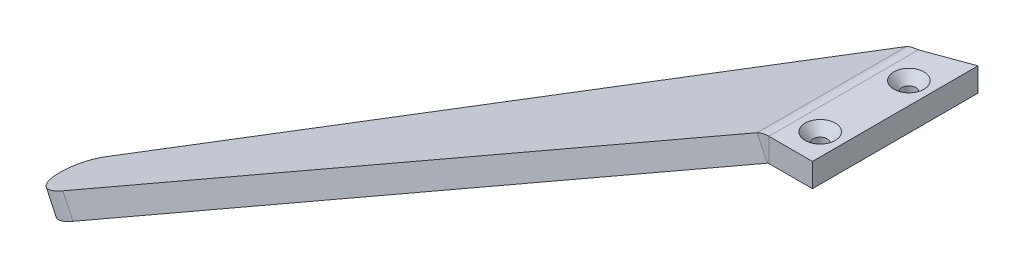
ISO-10303-21;
HEADER;
FILE_DESCRIPTION(('STEP AP214'),'2;1');
FILE_NAME('part.step','',(''),(''),'','','');
FILE_SCHEMA(('AUTOMOTIVE_DESIGN { 1 0 10303 214 1 1 1 1 }'));
ENDSEC;
DATA;
#1=APPLICATION_CONTEXT('core data for automotive mechanical design processes');
#2=APPLICATION_PROTOCOL_DEFINITION('international standard','automotive_design',2000,#1);
#3=PRODUCT_CONTEXT('',#1,'mechanical');
#4=PRODUCT('Part','Part','',(#3));
#5=PRODUCT_RELATED_PRODUCT_CATEGORY('part','',(#4));
#6=PRODUCT_DEFINITION_FORMATION('','',#4);
#7=PRODUCT_DEFINITION_CONTEXT('part definition',#1,'design');
#8=PRODUCT_DEFINITION('design','',#6,#7);
#9=PRODUCT_DEFINITION_SHAPE('','',#8);
#10=(LENGTH_UNIT() NAMED_UNIT(*) SI_UNIT(.MILLI.,.METRE.));
#11=(NAMED_UNIT(*) PLANE_ANGLE_UNIT() SI_UNIT($,.RADIAN.));
#12=(NAMED_UNIT(*) SI_UNIT($,.STERADIAN.) SOLID_ANGLE_UNIT());
#13=UNCERTAINTY_MEASURE_WITH_UNIT(LENGTH_MEASURE(1.E-05),#10,'distance_accuracy_value','');
#14=(GEOMETRIC_REPRESENTATION_CONTEXT(3) GLOBAL_UNCERTAINTY_ASSIGNED_CONTEXT((#13)) GLOBAL_UNIT_ASSIGNED_CONTEXT((#10,
#11,#12)) REPRESENTATION_CONTEXT('',''));
#15=CARTESIAN_POINT('',(0.,0.,0.));
#16=DIRECTION('',(0.,0.,1.));
#17=DIRECTION('',(1.,0.,0.));
#18=AXIS2_PLACEMENT_3D('',#15,#16,#17);
#19=CARTESIAN_POINT('',(0.,-5.08,0.));
#20=DIRECTION('',(0.,1.,0.));
#21=DIRECTION('',(0.,0.,1.));
#22=AXIS2_PLACEMENT_3D('',#19,#20,#21);
#23=PLANE('',#22);
#24=CARTESIAN_POINT('',(-4.68084985574861,-5.08,11.43));
#25=DIRECTION('',(0.,1.,0.));
#26=DIRECTION('',(0.,0.,1.));
#27=AXIS2_PLACEMENT_3D('',#24,#25,#26);
#28=CIRCLE('',#27,1.47319999999999);
#29=CARTESIAN_POINT('',(-4.68084985574861,-5.08,12.9032));
#30=VERTEX_POINT('',#29);
#31=EDGE_CURVE('E245',#30,#30,#28,.T.);
#32=ORIENTED_EDGE('',*,*,#31,.T.);
#33=EDGE_LOOP('',(#32));
#34=FACE_BOUND('',#33,.T.);
#35=CARTESIAN_POINT('',(-4.68084985574861,-5.08,-7.62));
#36=DIRECTION('',(0.,1.,0.));
#37=DIRECTION('',(0.,0.,1.));
#38=AXIS2_PLACEMENT_3D('',#35,#36,#37);
#39=CIRCLE('',#38,1.47319999999999);
#40=CARTESIAN_POINT('',(-4.68084985574861,-5.08,-6.14680000000002));
#41=VERTEX_POINT('',#40);
#42=EDGE_CURVE('E241',#41,#41,#39,.T.);
#43=ORIENTED_EDGE('',*,*,#42,.T.);
#44=EDGE_LOOP('',(#43));
#45=FACE_BOUND('',#44,.T.);
#46=DIRECTION('',(1.,1.06229051514945E-13,0.));
#47=VECTOR('',#46,1.);
#48=CARTESIAN_POINT('',(-9.525,-5.08,-14.3131835186145));
#49=LINE('',#48,#47);
#50=CARTESIAN_POINT('',(-9.525,-5.08,-14.3131835186145));
#51=VERTEX_POINT('',#50);
#52=CARTESIAN_POINT('',(-9.36169971149721,-5.07999999999998,-14.3131835186145));
#53=VERTEX_POINT('',#52);
#54=EDGE_CURVE('E208',#51,#53,#49,.T.);
#55=ORIENTED_EDGE('',*,*,#54,.F.);
#56=DIRECTION('',(-0.93969262078591,0.,0.342020143325663));
#57=VECTOR('',#56,1.);
#58=CARTESIAN_POINT('',(0.,-5.08,-17.78));
#59=LINE('',#58,#57);
#60=CARTESIAN_POINT('',(0.,-5.08,-17.78));
#61=VERTEX_POINT('',#60);
#62=EDGE_CURVE('E217',#61,#51,#59,.T.);
#63=ORIENTED_EDGE('',*,*,#62,.F.);
#64=DIRECTION('',(0.,0.,-1.));
#65=VECTOR('',#64,1.);
#66=CARTESIAN_POINT('',(0.,-5.08,-17.78));
#67=LINE('',#66,#65);
#68=CARTESIAN_POINT('',(0.,-5.08,17.78));
#69=VERTEX_POINT('',#68);
#70=EDGE_CURVE('E214',#69,#61,#67,.T.);
#71=ORIENTED_EDGE('',*,*,#70,.F.);
#72=DIRECTION('',(1.,0.,0.));
#73=VECTOR('',#72,1.);
#74=CARTESIAN_POINT('',(-9.525,-5.08,17.78));
#75=LINE('',#74,#73);
#76=CARTESIAN_POINT('',(-9.36169971149721,-5.08,17.78));
#77=VERTEX_POINT('',#76);
#78=EDGE_CURVE('E221',#77,#69,#75,.T.);
#79=ORIENTED_EDGE('',*,*,#78,.F.);
#80=DIRECTION('',(0.,0.,-1.));
#81=VECTOR('',#80,1.);
#82=CARTESIAN_POINT('',(-9.36169971149721,-5.07999999999998,-14.3131835186145));
#83=LINE('',#82,#81);
#84=EDGE_CURVE('E164',#53,#77,#83,.F.);
#85=ORIENTED_EDGE('',*,*,#84,.F.);
#86=EDGE_LOOP('',(#55,#63,#71,#79,#85));
#87=FACE_BOUND('',#86,.T.);
#88=ADVANCED_FACE('F39',(#34,#45,#87),#23,.F.);
#89=CARTESIAN_POINT('',(0.,0.,0.));
#90=DIRECTION('',(0.,1.,0.));
#91=DIRECTION('',(0.,0.,1.));
#92=AXIS2_PLACEMENT_3D('',#89,#90,#91);
#93=PLANE('',#92);
#94=CARTESIAN_POINT('',(-4.68084985574861,0.,11.43));
#95=DIRECTION('',(0.,1.,0.));
#96=DIRECTION('',(0.,0.,1.));
#97=AXIS2_PLACEMENT_3D('',#94,#95,#96);
#98=CIRCLE('',#97,3.2385);
#99=CARTESIAN_POINT('',(-4.68084985574861,0.,14.6685));
#100=VERTEX_POINT('',#99);
#101=EDGE_CURVE('E288',#100,#100,#98,.T.);
#102=ORIENTED_EDGE('',*,*,#101,.F.);
#103=EDGE_LOOP('',(#102));
#104=FACE_BOUND('',#103,.T.);
#105=CARTESIAN_POINT('',(-4.68084985574861,0.,-7.62));
#106=DIRECTION('',(0.,1.,0.));
#107=DIRECTION('',(0.,0.,1.));
#108=AXIS2_PLACEMENT_3D('',#105,#106,#107);
#109=CIRCLE('',#108,3.2385);
#110=CARTESIAN_POINT('',(-4.68084985574861,0.,-4.3815));
#111=VERTEX_POINT('',#110);
#112=EDGE_CURVE('E248',#111,#111,#109,.T.);
#113=ORIENTED_EDGE('',*,*,#112,.F.);
#114=EDGE_LOOP('',(#113));
#115=FACE_BOUND('',#114,.T.);
#116=DIRECTION('',(-0.93969262078591,0.,0.342020143325663));
#117=VECTOR('',#116,1.);
#118=CARTESIAN_POINT('',(0.,0.,-17.78));
#119=LINE('',#118,#117);
#120=CARTESIAN_POINT('',(0.,0.,-17.78));
#121=VERTEX_POINT('',#120);
#122=CARTESIAN_POINT('',(-9.525,0.,-14.3131835186145));
#123=VERTEX_POINT('',#122);
#124=EDGE_CURVE('E226',#121,#123,#119,.T.);
#125=ORIENTED_EDGE('',*,*,#124,.T.);
#126=DIRECTION('',(1.,0.,0.));
#127=VECTOR('',#126,1.);
#128=CARTESIAN_POINT('',(0.,0.,-14.3131835186145));
#129=LINE('',#128,#127);
#130=CARTESIAN_POINT('',(-9.36169971149722,0.,-14.3131835186145));
#131=VERTEX_POINT('',#130);
#132=EDGE_CURVE('E233',#123,#131,#129,.T.);
#133=ORIENTED_EDGE('',*,*,#132,.T.);
#134=DIRECTION('',(0.,0.,-1.));
#135=VECTOR('',#134,1.);
#136=CARTESIAN_POINT('',(-9.36169971149722,0.,-14.3131835186145));
#137=LINE('',#136,#135);
#138=CARTESIAN_POINT('',(-9.36169971149721,0.,17.78));
#139=VERTEX_POINT('',#138);
#140=EDGE_CURVE('E136',#131,#139,#137,.F.);
#141=ORIENTED_EDGE('',*,*,#140,.T.);
#142=DIRECTION('',(1.,0.,0.));
#143=VECTOR('',#142,1.);
#144=CARTESIAN_POINT('',(-9.525,0.,17.78));
#145=LINE('',#144,#143);
#146=CARTESIAN_POINT('',(0.,0.,17.78));
#147=VERTEX_POINT('',#146);
#148=EDGE_CURVE('E218',#139,#147,#145,.T.);
#149=ORIENTED_EDGE('',*,*,#148,.T.);
#150=DIRECTION('',(0.,0.,-1.));
#151=VECTOR('',#150,1.);
#152=CARTESIAN_POINT('',(0.,0.,-17.78));
#153=LINE('',#152,#151);
#154=EDGE_CURVE('E213',#147,#121,#153,.T.);
#155=ORIENTED_EDGE('',*,*,#154,.T.);
#156=EDGE_LOOP('',(#125,#133,#141,#149,#155));
#157=FACE_BOUND('',#156,.T.);
#158=ADVANCED_FACE('F294',(#104,#115,#157),#93,.T.);
#159=CARTESIAN_POINT('',(0.,-5.08,-17.78));
#160=DIRECTION('',(1.,0.,0.));
#161=DIRECTION('',(0.,0.,-1.));
#162=AXIS2_PLACEMENT_3D('',#159,#160,#161);
#163=PLANE('',#162);
#164=ORIENTED_EDGE('',*,*,#154,.F.);
#165=DIRECTION('',(0.,1.,0.));
#166=VECTOR('',#165,1.);
#167=CARTESIAN_POINT('',(0.,-5.08,17.78));
#168=LINE('',#167,#166);
#169=EDGE_CURVE('E230',#69,#147,#168,.T.);
#170=ORIENTED_EDGE('',*,*,#169,.F.);
#171=ORIENTED_EDGE('',*,*,#70,.T.);
#172=DIRECTION('',(0.,1.,0.));
#173=VECTOR('',#172,1.);
#174=CARTESIAN_POINT('',(0.,-5.08,-17.78));
#175=LINE('',#174,#173);
#176=EDGE_CURVE('E223',#61,#121,#175,.T.);
#177=ORIENTED_EDGE('',*,*,#176,.T.);
#178=EDGE_LOOP('',(#164,#170,#171,#177));
#179=FACE_BOUND('',#178,.T.);
#180=ADVANCED_FACE('F297',(#179),#163,.T.);
#181=CARTESIAN_POINT('',(-9.525,-5.08,17.78));
#182=DIRECTION('',(0.,0.,1.));
#183=DIRECTION('',(1.,0.,0.));
#184=AXIS2_PLACEMENT_3D('',#181,#182,#183);
#185=PLANE('',#184);
#186=DIRECTION('',(0.,1.,0.));
#187=VECTOR('',#186,1.);
#188=CARTESIAN_POINT('',(-9.36169971149721,-5.08,17.78));
#189=LINE('',#188,#187);
#190=EDGE_CURVE('E200',#77,#139,#189,.T.);
#191=ORIENTED_EDGE('',*,*,#190,.F.);
#192=ORIENTED_EDGE('',*,*,#78,.T.);
#193=ORIENTED_EDGE('',*,*,#169,.T.);
#194=ORIENTED_EDGE('',*,*,#148,.F.);
#195=EDGE_LOOP('',(#191,#192,#193,#194));
#196=FACE_BOUND('',#195,.T.);
#197=ADVANCED_FACE('F317',(#196),#185,.T.);
#198=CARTESIAN_POINT('',(0.,-5.08,-17.78));
#199=DIRECTION('',(-0.342020143325663,0.,-0.939692620785911));
#200=DIRECTION('',(-0.939692620785911,0.,0.342020143325663));
#201=AXIS2_PLACEMENT_3D('',#198,#199,#200);
#202=PLANE('',#201);
#203=ORIENTED_EDGE('',*,*,#124,.F.);
#204=ORIENTED_EDGE('',*,*,#176,.F.);
#205=ORIENTED_EDGE('',*,*,#62,.T.);
#206=DIRECTION('',(0.,1.,0.));
#207=VECTOR('',#206,1.);
#208=CARTESIAN_POINT('',(-9.525,-5.08,-14.3131835186145));
#209=LINE('',#208,#207);
#210=EDGE_CURVE('E234',#51,#123,#209,.T.);
#211=ORIENTED_EDGE('',*,*,#210,.T.);
#212=EDGE_LOOP('',(#203,#204,#205,#211));
#213=FACE_BOUND('',#212,.T.);
#214=ADVANCED_FACE('F304',(#213),#202,.T.);
#215=CARTESIAN_POINT('',(-9.525,-5.08,-14.3131835186145));
#216=DIRECTION('',(0.,0.,1.));
#217=DIRECTION('',(0.,-1.,0.));
#218=AXIS2_PLACEMENT_3D('',#215,#216,#217);
#219=PLANE('',#218);
#220=ORIENTED_EDGE('',*,*,#132,.F.);
#221=ORIENTED_EDGE('',*,*,#210,.F.);
#222=ORIENTED_EDGE('',*,*,#54,.T.);
#223=DIRECTION('',(0.,1.,0.));
#224=VECTOR('',#223,1.);
#225=CARTESIAN_POINT('',(-9.36169971149721,-5.07999999999998,-14.3131835186145));
#226=LINE('',#225,#224);
#227=EDGE_CURVE('E209',#53,#131,#226,.T.);
#228=ORIENTED_EDGE('',*,*,#227,.T.);
#229=EDGE_LOOP('',(#220,#221,#222,#228));
#230=FACE_BOUND('',#229,.T.);
#231=ADVANCED_FACE('F308',(#230),#219,.T.);
#232=CARTESIAN_POINT('',(-9.3616997114972,0.0507999999999974,17.78));
#233=CARTESIAN_POINT('',(-10.2158112247496,0.0507999999999995,17.7922662124768));
#234=CARTESIAN_POINT('',(-11.0672821849762,-0.137966567277697,17.80450085123));
#235=CARTESIAN_POINT('',(-11.8413701004345,-0.498929690341135,17.8167670637068));
#236=CARTESIAN_POINT('',(-9.3616997114972,0.,17.78));
#237=CARTESIAN_POINT('',(-10.2084163108103,0.,17.792266211431));
#238=CARTESIAN_POINT('',(-11.0525152453674,-0.187132228533888,17.8045008522758));
#239=CARTESIAN_POINT('',(-11.8199010927381,-0.544970125922597,17.8167670637068));
#240=CARTESIAN_POINT('',(-9.36169971149721,-5.08,17.78));
#241=CARTESIAN_POINT('',(-9.46892491688511,-5.08,17.7922661068532));
#242=CARTESIAN_POINT('',(-9.57582128448574,-5.10369835415298,17.8045009568536));
#243=CARTESIAN_POINT('',(-9.6730003230954,-5.1490136840688,17.8167670637068));
#244=B_SPLINE_SURFACE_WITH_KNOTS('',1,3,((#232,#233,#234,#235),(#236,#237,#238,#239),(#240,#241,
#242,#243)),.UNSPECIFIED.,.F.,.F.,.F.,(2,1,2),(4,4),(-0.01,0.,1.),(0.,1.),.UNSPECIFIED.);
#245=DIRECTION('',(-0.422618261740694,0.906307787036653,0.));
#246=VECTOR('',#245,1.);
#247=CARTESIAN_POINT('',(-9.6730003230954,-5.1490136840688,17.8167670637068));
#248=LINE('',#247,#246);
#249=CARTESIAN_POINT('',(-9.67300032309541,-5.14901368406881,17.8167670637068));
#250=VERTEX_POINT('',#249);
#251=CARTESIAN_POINT('',(-11.8199010927381,-0.544970125922609,17.8167670637068));
#252=VERTEX_POINT('',#251);
#253=EDGE_CURVE('E157',#250,#252,#248,.T.);
#254=CARTESIAN_POINT('',(-9.36169971149721,-5.08,17.78));
#255=CARTESIAN_POINT('',(-9.37509149795593,-5.07999961057904,17.7815319609878));
#256=CARTESIAN_POINT('',(-9.38848324766294,-5.08036518999271,17.7830639219756));
#257=CARTESIAN_POINT('',(-9.41522693914458,-5.08182548943323,17.7861278439511));
#258=CARTESIAN_POINT('',(-9.42857888091921,-5.08292020946007,17.7876598049389));
#259=CARTESIAN_POINT('',(-9.45520322210712,-5.08583599307081,17.7907237269145));
#260=CARTESIAN_POINT('',(-9.4684756215204,-5.0876570566547,17.7922556879023));
#261=CARTESIAN_POINT('',(-9.49490141287892,-5.09201998651786,17.7953196098778));
#262=CARTESIAN_POINT('',(-9.50805480482417,-5.09456185279713,17.7968515708656));
#263=CARTESIAN_POINT('',(-9.53420345742385,-5.10035886951379,17.7999154928412));
#264=CARTESIAN_POINT('',(-9.5471987180783,-5.10361401995117,17.801447453829));
#265=CARTESIAN_POINT('',(-9.5729924724,-5.11082788465096,17.8045113758045));
#266=CARTESIAN_POINT('',(-9.58579096606726,-5.11478659891335,17.8060433367923));
#267=CARTESIAN_POINT('',(-9.61115307721176,-5.12339593431446,17.8091072587679));
#268=CARTESIAN_POINT('',(-9.623716694689,-5.12804655545316,17.8106392197556));
#269=CARTESIAN_POINT('',(-9.64857185974409,-5.13802544710531,17.8137031417312));
#270=CARTESIAN_POINT('',(-9.66086340732194,-5.14335371761876,17.815235102719));
#271=CARTESIAN_POINT('',(-9.6730003230954,-5.1490136840688,17.8167670637068));
#272=B_SPLINE_CURVE_WITH_KNOTS('',3,(#254,#255,#256,#257,#258,#259,#260,#261,#262,#263,#264,
#265,#266,#267,#268,#269,#270,#271),.UNSPECIFIED.,.F.,.F.,(4,2,2,2,2,2,2,2,4),(0.,
0.0404323707610736,0.0808647415221451,0.121297112283219,0.161729483044292,0.202161853805365,
0.242594224566438,0.28302659532751,0.323458966088584),.UNSPECIFIED.);
#273=EDGE_CURVE('E139',#77,#250,#272,.T.);
#274=CARTESIAN_POINT('',(-9.3616997114972,0.,17.78));
#275=CARTESIAN_POINT('',(-9.46744864594711,3.07508279480733E-06,17.7815319609878));
#276=CARTESIAN_POINT('',(-9.57319729018524,-0.00288374166658068,17.7830639219756));
#277=CARTESIAN_POINT('',(-9.78438023326439,-0.014415071731368,17.7861278439511));
#278=CARTESIAN_POINT('',(-9.88981453210542,-0.0230595850467798,17.7876598049389));
#279=CARTESIAN_POINT('',(-10.1000550194168,-0.0460842211453303,17.7907237269145));
#280=CARTESIAN_POINT('',(-10.2048612078872,-0.0604643439284689,17.7922556879023));
#281=CARTESIAN_POINT('',(-10.4135338362011,-0.0949164452617081,17.7953196098778));
#282=CARTESIAN_POINT('',(-10.5174002760446,-0.114988423811809,17.7968515708656));
#283=CARTESIAN_POINT('',(-10.7238844638145,-0.160764866160569,17.7999154928412));
#284=CARTESIAN_POINT('',(-10.826502211741,-0.186469329959228,17.801447453829));
#285=CARTESIAN_POINT('',(-11.030183926902,-0.243433985692005,17.8045113758045));
#286=CARTESIAN_POINT('',(-11.1312478941366,-0.274694177626123,17.8060433367923));
#287=CARTESIAN_POINT('',(-11.3315211166225,-0.342678239931383,17.8091072587679));
#288=CARTESIAN_POINT('',(-11.4307303718738,-0.379402110302525,17.8106392197556));
#289=CARTESIAN_POINT('',(-11.6270004683433,-0.458200944383313,17.8137031417312));
#290=CARTESIAN_POINT('',(-11.7240613095615,-0.500275908092959,17.815235102719));
#291=CARTESIAN_POINT('',(-11.8199010927381,-0.544970125922596,17.8167670637068));
#292=B_SPLINE_CURVE_WITH_KNOTS('',3,(#274,#275,#276,#277,#278,#279,#280,#281,#282,#283,#284,
#285,#286,#287,#288,#289,#290,#291),.UNSPECIFIED.,.F.,.F.,(4,2,2,2,2,2,2,2,4),(0.,
0.317240287716915,0.634480575433834,0.951720863150749,1.26896115086767,1.58620143858458,
1.9034417263015,2.22068201401841,2.53792230173533),.UNSPECIFIED.);
#293=EDGE_CURVE('E191',#139,#252,#292,.T.);
#294=ORIENTED_EDGE('',*,*,#253,.F.);
#295=ORIENTED_EDGE('',*,*,#273,.F.);
#296=ORIENTED_EDGE('',*,*,#190,.T.);
#297=ORIENTED_EDGE('',*,*,#293,.T.);
#298=EDGE_LOOP('',(#294,#295,#296,#297));
#299=FACE_BOUND('',#298,.T.);
#300=ADVANCED_FACE('F184',(#299),#244,.F.);
#301=CARTESIAN_POINT('',(-11.8413701004346,-0.498929690341145,-14.2537470743524));
#302=CARTESIAN_POINT('',(-11.0672823471896,-0.137966642918995,-14.2735762342928));
#303=CARTESIAN_POINT('',(-10.2158110457671,0.0508000000000145,-14.2933543586741));
#304=CARTESIAN_POINT('',(-9.36169971149722,0.0508000000000165,-14.3131835186145));
#305=CARTESIAN_POINT('',(-11.8199010927382,-0.544970125922607,-14.2537470743524));
#306=CARTESIAN_POINT('',(-11.0525154190774,-0.187132309536161,-14.2735762299468));
#307=CARTESIAN_POINT('',(-10.2084161191427,0.,-14.2933543630201));
#308=CARTESIAN_POINT('',(-9.36169971149722,0.,-14.3131835186145));
#309=CARTESIAN_POINT('',(-9.67300032309541,-5.14901368406879,-14.2537470743524));
#310=CARTESIAN_POINT('',(-9.5758226078605,-5.10369897125274,-14.273575795349));
#311=CARTESIAN_POINT('',(-9.46892345670264,-5.07999999999998,-14.2933547976178));
#312=CARTESIAN_POINT('',(-9.36169971149721,-5.07999999999998,-14.3131835186145));
#313=B_SPLINE_SURFACE_WITH_KNOTS('',1,3,((#301,#302,#303,#304),(#305,#306,#307,#308),(#309,#310,
#311,#312)),.UNSPECIFIED.,.F.,.F.,.F.,(2,1,2),(4,4),(-0.01,0.,1.),(0.,1.),.UNSPECIFIED.);
#314=CARTESIAN_POINT('',(-9.67300032309541,-5.14901368406879,-14.2537470743524));
#315=CARTESIAN_POINT('',(-9.66086340732195,-5.14335371761875,-14.2562235928633));
#316=CARTESIAN_POINT('',(-9.6485718597441,-5.1380254471053,-14.2587001113742));
#317=CARTESIAN_POINT('',(-9.62371669468901,-5.12804655545315,-14.2636531483961));
#318=CARTESIAN_POINT('',(-9.61115307721177,-5.12339593431444,-14.266129666907));
#319=CARTESIAN_POINT('',(-9.58579096606727,-5.11478659891334,-14.2710827039288));
#320=CARTESIAN_POINT('',(-9.57299247240001,-5.11082788465094,-14.2735592224398));
#321=CARTESIAN_POINT('',(-9.5471987180783,-5.10361401995115,-14.2785122594616));
#322=CARTESIAN_POINT('',(-9.53420345742386,-5.10035886951377,-14.2809887779725));
#323=CARTESIAN_POINT('',(-9.50805480482417,-5.09456185279711,-14.2859418149944));
#324=CARTESIAN_POINT('',(-9.49490141287893,-5.09201998651784,-14.2884183335053));
#325=CARTESIAN_POINT('',(-9.4684756215204,-5.08765705665468,-14.2933713705271));
#326=CARTESIAN_POINT('',(-9.45520322210712,-5.08583599307079,-14.295847889038));
#327=CARTESIAN_POINT('',(-9.42857888091921,-5.08292020946006,-14.3008009260599));
#328=CARTESIAN_POINT('',(-9.41522693914458,-5.08182548943321,-14.3032774445708));
#329=CARTESIAN_POINT('',(-9.38848324766295,-5.08036518999269,-14.3082304815926));
#330=CARTESIAN_POINT('',(-9.37509149795593,-5.07999961057902,-14.3107070001036));
#331=CARTESIAN_POINT('',(-9.36169971149721,-5.07999999999998,-14.3131835186145));
#332=B_SPLINE_CURVE_WITH_KNOTS('',3,(#314,#315,#316,#317,#318,#319,#320,#321,#322,#323,#324,
#325,#326,#327,#328,#329,#330,#331),.UNSPECIFIED.,.F.,.F.,(4,2,2,2,2,2,2,2,4),(0.,
0.0408515943454171,0.0817031886908347,0.122554783036252,0.163406377381669,0.204257971727086,
0.245109566072504,0.285961160417921,0.326812754763338),.UNSPECIFIED.);
#333=CARTESIAN_POINT('',(-9.67300032309541,-5.14901368406879,-14.2537470743524));
#334=VERTEX_POINT('',#333);
#335=EDGE_CURVE('E126',#334,#53,#332,.T.);
#336=DIRECTION('',(-0.422618261740694,0.906307787036653,0.));
#337=VECTOR('',#336,1.);
#338=CARTESIAN_POINT('',(-9.6730003230954,-5.1490136840688,-14.2537470743524));
#339=LINE('',#338,#337);
#340=CARTESIAN_POINT('',(-11.8199010927381,-0.544970125922606,-14.2537470743524));
#341=VERTEX_POINT('',#340);
#342=EDGE_CURVE('E124',#334,#341,#339,.T.);
#343=CARTESIAN_POINT('',(-11.8199010927382,-0.544970125922607,-14.2537470743524));
#344=CARTESIAN_POINT('',(-11.7240613095615,-0.500275908092969,-14.2562235928633));
#345=CARTESIAN_POINT('',(-11.6270004683434,-0.458200944383321,-14.2587001113742));
#346=CARTESIAN_POINT('',(-11.4307303718739,-0.379402110302529,-14.2636531483961));
#347=CARTESIAN_POINT('',(-11.3315211166225,-0.342678239931384,-14.266129666907));
#348=CARTESIAN_POINT('',(-11.1312478941366,-0.274694177626121,-14.2710827039288));
#349=CARTESIAN_POINT('',(-11.0301839269021,-0.243433985692003,-14.2735592224398));
#350=CARTESIAN_POINT('',(-10.826502211741,-0.186469329959223,-14.2785122594616));
#351=CARTESIAN_POINT('',(-10.7238844638146,-0.160764866160562,-14.2809887779725));
#352=CARTESIAN_POINT('',(-10.5174002760446,-0.114988423811799,-14.2859418149944));
#353=CARTESIAN_POINT('',(-10.4135338362011,-0.094916445261698,-14.2884183335053));
#354=CARTESIAN_POINT('',(-10.2048612078872,-0.0604643439284564,-14.2933713705271));
#355=CARTESIAN_POINT('',(-10.1000550194169,-0.0460842211453157,-14.295847889038));
#356=CARTESIAN_POINT('',(-9.88981453210545,-0.0230595850467633,-14.3008009260599));
#357=CARTESIAN_POINT('',(-9.78438023326443,-0.0144150717313516,-14.3032774445708));
#358=CARTESIAN_POINT('',(-9.57319729018527,-0.00288374166656401,-14.3082304815926));
#359=CARTESIAN_POINT('',(-9.46744864594714,3.07508281189462E-06,-14.3107070001036));
#360=CARTESIAN_POINT('',(-9.36169971149722,0.,-14.3131835186145));
#361=B_SPLINE_CURVE_WITH_KNOTS('',3,(#343,#344,#345,#346,#347,#348,#349,#350,#351,#352,#353,
#354,#355,#356,#357,#358,#359,#360),.UNSPECIFIED.,.F.,.F.,(4,2,2,2,2,2,2,2,4),(0.,
0.317293990340058,0.634587980680117,0.951881971020175,1.26917596136023,1.58646995170029,
1.90376394204035,2.22105793238041,2.53835192272047),.UNSPECIFIED.);
#362=EDGE_CURVE('E131',#341,#131,#361,.T.);
#363=ORIENTED_EDGE('',*,*,#335,.F.);
#364=ORIENTED_EDGE('',*,*,#342,.T.);
#365=ORIENTED_EDGE('',*,*,#362,.T.);
#366=ORIENTED_EDGE('',*,*,#227,.F.);
#367=EDGE_LOOP('',(#363,#364,#365,#366));
#368=FACE_BOUND('',#367,.T.);
#369=ADVANCED_FACE('F142',(#368),#313,.F.);
#370=CARTESIAN_POINT('',(-9.36169971149721,-5.81659999999999,-14.3131835186145));
#371=DIRECTION('',(0.,0.,-1.));
#372=DIRECTION('',(-0.422618261740694,0.906307787036653,0.));
#373=AXIS2_PLACEMENT_3D('',#370,#371,#372);
#374=CYLINDRICAL_SURFACE('',#373,5.8166);
#375=ORIENTED_EDGE('',*,*,#140,.F.);
#376=ORIENTED_EDGE('',*,*,#362,.F.);
#377=DIRECTION('',(0.,0.,-1.));
#378=VECTOR('',#377,1.);
#379=CARTESIAN_POINT('',(-11.8199010927381,-0.544970125922606,0.));
#380=LINE('',#379,#378);
#381=EDGE_CURVE('E133',#252,#341,#380,.T.);
#382=ORIENTED_EDGE('',*,*,#381,.F.);
#383=ORIENTED_EDGE('',*,*,#293,.F.);
#384=EDGE_LOOP('',(#375,#376,#382,#383));
#385=FACE_BOUND('',#384,.T.);
#386=ADVANCED_FACE('F132',(#385),#374,.T.);
#387=CARTESIAN_POINT('',(-9.36169971149721,-5.81659999999999,-14.3131835186145));
#388=DIRECTION('',(0.,0.,-1.));
#389=DIRECTION('',(-0.422618261740694,0.906307787036653,0.));
#390=AXIS2_PLACEMENT_3D('',#387,#388,#389);
#391=CYLINDRICAL_SURFACE('',#390,0.736600000000003);
#392=ORIENTED_EDGE('',*,*,#84,.T.);
#393=ORIENTED_EDGE('',*,*,#273,.T.);
#394=DIRECTION('',(0.,0.,-1.));
#395=VECTOR('',#394,1.);
#396=CARTESIAN_POINT('',(-9.6730003230954,-5.1490136840688,17.8167670637068));
#397=LINE('',#396,#395);
#398=EDGE_CURVE('E144',#250,#334,#397,.T.);
#399=ORIENTED_EDGE('',*,*,#398,.T.);
#400=ORIENTED_EDGE('',*,*,#335,.T.);
#401=EDGE_LOOP('',(#392,#393,#399,#400));
#402=FACE_BOUND('',#401,.T.);
#403=ADVANCED_FACE('F171',(#402),#391,.F.);
#404=CARTESIAN_POINT('',(-11.6719007696427,-0.475956441853806,-14.3131835186145));
#405=DIRECTION('',(-0.30997551921944,-0.144543958452595,-0.939692620785911));
#406=DIRECTION('',(-0.949665648528749,0.,0.31326531248204));
#407=AXIS2_PLACEMENT_3D('',#404,#405,#406);
#408=PLANE('',#407);
#409=DIRECTION('',(0.851650739639151,0.397131261967098,-0.342020143325663));
#410=VECTOR('',#409,1.);
#411=CARTESIAN_POINT('',(-9.525,-5.08,-14.3131835186145));
#412=LINE('',#411,#410);
#413=CARTESIAN_POINT('',(-132.349487948381,-62.3539993392955,35.0127279340142));
#414=VERTEX_POINT('',#413);
#415=EDGE_CURVE('E159',#414,#334,#412,.T.);
#416=ORIENTED_EDGE('',*,*,#415,.F.);
#417=DIRECTION('',(0.422618261740694,-0.906307787036653,0.));
#418=VECTOR('',#417,1.);
#419=CARTESIAN_POINT('',(-134.496388718024,-57.7499557811493,35.0127279340141));
#420=LINE('',#419,#418);
#421=CARTESIAN_POINT('',(-134.496388718024,-57.7499557811493,35.0127279340142));
#422=VERTEX_POINT('',#421);
#423=EDGE_CURVE('E11',#414,#422,#420,.F.);
#424=ORIENTED_EDGE('',*,*,#423,.T.);
#425=DIRECTION('',(0.851650739639151,0.397131261967098,-0.342020143325663));
#426=VECTOR('',#425,1.);
#427=CARTESIAN_POINT('',(-11.6719007696427,-0.475956441853806,-14.3131835186145));
#428=LINE('',#427,#426);
#429=EDGE_CURVE('E120',#422,#341,#428,.T.);
#430=ORIENTED_EDGE('',*,*,#429,.T.);
#431=ORIENTED_EDGE('',*,*,#342,.F.);
#432=EDGE_LOOP('',(#416,#424,#430,#431));
#433=FACE_BOUND('',#432,.T.);
#434=ADVANCED_FACE('F122',(#433),#408,.T.);
#435=CARTESIAN_POINT('',(-11.6719007696427,-0.475956441853806,17.78));
#436=DIRECTION('',(0.199071864562541,0.0928287349687058,0.975578402130604));
#437=DIRECTION('',(0.9798091289709,0.,-0.199935166454744));
#438=AXIS2_PLACEMENT_3D('',#435,#436,#437);
#439=PLANE('',#438);
#440=DIRECTION('',(-0.884174302715742,-0.4122972485002,0.219651499644998));
#441=VECTOR('',#440,1.);
#442=CARTESIAN_POINT('',(-11.6719007696427,-0.475956441853806,17.78));
#443=LINE('',#442,#441);
#444=CARTESIAN_POINT('',(-131.263937831008,-56.242639177924,47.4897192323337));
#445=VERTEX_POINT('',#444);
#446=EDGE_CURVE('E149',#252,#445,#443,.T.);
#447=ORIENTED_EDGE('',*,*,#446,.T.);
#448=DIRECTION('',(0.422618261740694,-0.906307787036653,0.));
#449=VECTOR('',#448,1.);
#450=CARTESIAN_POINT('',(-131.263937831008,-56.242639177924,47.4897192323337));
#451=LINE('',#450,#449);
#452=CARTESIAN_POINT('',(-129.117037061366,-60.8466827360702,47.4897192323337));
#453=VERTEX_POINT('',#452);
#454=EDGE_CURVE('E240',#445,#453,#451,.T.);
#455=ORIENTED_EDGE('',*,*,#454,.T.);
#456=DIRECTION('',(-0.884174302715742,-0.4122972485002,0.219651499644998));
#457=VECTOR('',#456,1.);
#458=CARTESIAN_POINT('',(-9.525,-5.08,17.78));
#459=LINE('',#458,#457);
#460=EDGE_CURVE('E150',#250,#453,#459,.T.);
#461=ORIENTED_EDGE('',*,*,#460,.F.);
#462=ORIENTED_EDGE('',*,*,#253,.T.);
#463=EDGE_LOOP('',(#447,#455,#461,#462));
#464=FACE_BOUND('',#463,.T.);
#465=ADVANCED_FACE('F267',(#464),#439,.T.);
#466=CARTESIAN_POINT('',(-1.90237189298835,4.07964968989645,0.));
#467=DIRECTION('',(-0.422618261740694,0.906307787036652,0.));
#468=DIRECTION('',(-0.906307787036653,-0.422618261740694,0.));
#469=AXIS2_PLACEMENT_3D('',#466,#467,#468);
#470=PLANE('',#469);
#471=DIRECTION('',(0.,0.,-1.));
#472=VECTOR('',#471,1.);
#473=CARTESIAN_POINT('',(-138.283098618663,-59.5157276070287,49.233458208373));
#474=LINE('',#473,#472);
#475=CARTESIAN_POINT('',(-138.283098618663,-59.5157276070287,41.2947963788044));
#476=VERTEX_POINT('',#475);
#477=CARTESIAN_POINT('',(-138.283098618663,-59.5157276070287,40.9797760760047));
#478=VERTEX_POINT('',#477);
#479=EDGE_CURVE('E127',#476,#478,#474,.T.);
#480=ORIENTED_EDGE('',*,*,#479,.F.);
#481=CARTESIAN_POINT('',(-132.52804417098,-56.8321016449753,41.2947963788044));
#482=DIRECTION('',(-0.422618261740694,0.906307787036652,0.));
#483=DIRECTION('',(-0.906307787036653,-0.422618261740694,0.));
#484=AXIS2_PLACEMENT_3D('',#481,#482,#483);
#485=CIRCLE('',#484,6.35);
#486=EDGE_CURVE('E47',#476,#445,#485,.T.);
#487=ORIENTED_EDGE('',*,*,#486,.T.);
#488=ORIENTED_EDGE('',*,*,#446,.F.);
#489=ORIENTED_EDGE('',*,*,#381,.T.);
#490=ORIENTED_EDGE('',*,*,#429,.F.);
#491=CARTESIAN_POINT('',(-132.52804417098,-56.8321016449753,40.9797760760047));
#492=DIRECTION('',(-0.422618261740694,0.906307787036652,0.));
#493=DIRECTION('',(-0.906307787036653,-0.422618261740694,0.));
#494=AXIS2_PLACEMENT_3D('',#491,#492,#493);
#495=CIRCLE('',#494,6.35);
#496=EDGE_CURVE('E59',#422,#478,#495,.T.);
#497=ORIENTED_EDGE('',*,*,#496,.T.);
#498=EDGE_LOOP('',(#480,#487,#488,#489,#490,#497));
#499=FACE_BOUND('',#498,.T.);
#500=ADVANCED_FACE('F147',(#499),#470,.T.);
#501=CARTESIAN_POINT('',(0.244528876654374,-0.524393868249741,0.));
#502=DIRECTION('',(-0.422618261740694,0.906307787036652,0.));
#503=DIRECTION('',(-0.906307787036653,-0.422618261740694,0.));
#504=AXIS2_PLACEMENT_3D('',#501,#502,#503);
#505=PLANE('',#504);
#506=ORIENTED_EDGE('',*,*,#460,.T.);
#507=CARTESIAN_POINT('',(-130.381143401338,-61.4361452031215,41.2947963788044));
#508=DIRECTION('',(-0.422618261740694,0.906307787036652,0.));
#509=DIRECTION('',(-0.906307787036653,-0.422618261740694,0.));
#510=AXIS2_PLACEMENT_3D('',#507,#508,#509);
#511=CIRCLE('',#510,6.35);
#512=CARTESIAN_POINT('',(-136.13619784902,-64.1197711651749,41.2947963788044));
#513=VERTEX_POINT('',#512);
#514=EDGE_CURVE('E254',#453,#513,#511,.F.);
#515=ORIENTED_EDGE('',*,*,#514,.T.);
#516=DIRECTION('',(0.,0.,-1.));
#517=VECTOR('',#516,1.);
#518=CARTESIAN_POINT('',(-136.13619784902,-64.1197711651749,49.233458208373));
#519=LINE('',#518,#517);
#520=CARTESIAN_POINT('',(-136.13619784902,-64.1197711651749,40.9797760760047));
#521=VERTEX_POINT('',#520);
#522=EDGE_CURVE('E153',#513,#521,#519,.T.);
#523=ORIENTED_EDGE('',*,*,#522,.T.);
#524=CARTESIAN_POINT('',(-130.381143401338,-61.4361452031215,40.9797760760047));
#525=DIRECTION('',(-0.422618261740694,0.906307787036652,0.));
#526=DIRECTION('',(-0.906307787036653,-0.422618261740694,0.));
#527=AXIS2_PLACEMENT_3D('',#524,#525,#526);
#528=CIRCLE('',#527,6.35);
#529=EDGE_CURVE('E252',#521,#414,#528,.F.);
#530=ORIENTED_EDGE('',*,*,#529,.T.);
#531=ORIENTED_EDGE('',*,*,#415,.T.);
#532=ORIENTED_EDGE('',*,*,#398,.F.);
#533=EDGE_LOOP('',(#506,#515,#523,#530,#531,#532));
#534=FACE_BOUND('',#533,.T.);
#535=ADVANCED_FACE('F272',(#534),#505,.F.);
#536=CARTESIAN_POINT('',(-138.283098618663,-59.5157276070287,49.233458208373));
#537=DIRECTION('',(-0.906307787036652,-0.422618261740694,0.));
#538=DIRECTION('',(0.422618261740694,-0.906307787036653,0.));
#539=AXIS2_PLACEMENT_3D('',#536,#537,#538);
#540=PLANE('',#539);
#541=ORIENTED_EDGE('',*,*,#522,.F.);
#542=DIRECTION('',(0.422618261740694,-0.906307787036653,0.));
#543=VECTOR('',#542,1.);
#544=CARTESIAN_POINT('',(-138.283098618663,-59.5157276070287,41.2947963788044));
#545=LINE('',#544,#543);
#546=EDGE_CURVE('E259',#513,#476,#545,.F.);
#547=ORIENTED_EDGE('',*,*,#546,.T.);
#548=ORIENTED_EDGE('',*,*,#479,.T.);
#549=DIRECTION('',(0.422618261740694,-0.906307787036653,0.));
#550=VECTOR('',#549,1.);
#551=CARTESIAN_POINT('',(-138.283098618663,-59.5157276070287,40.9797760760047));
#552=LINE('',#551,#550);
#553=EDGE_CURVE('E256',#478,#521,#552,.T.);
#554=ORIENTED_EDGE('',*,*,#553,.T.);
#555=EDGE_LOOP('',(#541,#547,#548,#554));
#556=FACE_BOUND('',#555,.T.);
#557=ADVANCED_FACE('F275',(#556),#540,.T.);
#558=CARTESIAN_POINT('',(-4.68084985574861,0.,-7.62));
#559=DIRECTION('',(0.,1.,0.));
#560=DIRECTION('',(0.,0.,1.));
#561=AXIS2_PLACEMENT_3D('',#558,#559,#560);
#562=CYLINDRICAL_SURFACE('',#561,1.47319999999999);
#563=CARTESIAN_POINT('',(-4.68084985574861,-2.03074534926725,-7.62));
#564=DIRECTION('',(0.,1.,0.));
#565=DIRECTION('',(0.,0.,1.));
#566=AXIS2_PLACEMENT_3D('',#563,#564,#565);
#567=CIRCLE('',#566,1.47319999999999);
#568=CARTESIAN_POINT('',(-4.68084985574861,-2.03074534926725,-6.14680000000002));
#569=VERTEX_POINT('',#568);
#570=EDGE_CURVE('E244',#569,#569,#567,.T.);
#571=ORIENTED_EDGE('',*,*,#570,.T.);
#572=EDGE_LOOP('',(#571));
#573=FACE_BOUND('',#572,.T.);
#574=ORIENTED_EDGE('',*,*,#42,.F.);
#575=EDGE_LOOP('',(#574));
#576=FACE_BOUND('',#575,.T.);
#577=ADVANCED_FACE('F390',(#573,#576),#562,.F.);
#578=CARTESIAN_POINT('',(-4.68084985574861,0.,-7.62));
#579=DIRECTION('',(0.,1.,0.));
#580=DIRECTION('',(0.,0.,1.));
#581=AXIS2_PLACEMENT_3D('',#578,#579,#580);
#582=CONICAL_SURFACE('',#581,3.2385,0.715584993317677);
#583=ORIENTED_EDGE('',*,*,#570,.F.);
#584=EDGE_LOOP('',(#583));
#585=FACE_BOUND('',#584,.T.);
#586=ORIENTED_EDGE('',*,*,#112,.T.);
#587=EDGE_LOOP('',(#586));
#588=FACE_BOUND('',#587,.T.);
#589=ADVANCED_FACE('F398',(#585,#588),#582,.F.);
#590=CARTESIAN_POINT('',(-4.68084985574861,0.,11.43));
#591=DIRECTION('',(0.,1.,0.));
#592=DIRECTION('',(0.,0.,1.));
#593=AXIS2_PLACEMENT_3D('',#590,#591,#592);
#594=CYLINDRICAL_SURFACE('',#593,1.47319999999999);
#595=CARTESIAN_POINT('',(-4.68084985574861,-2.03074534926725,11.43));
#596=DIRECTION('',(0.,1.,0.));
#597=DIRECTION('',(0.,0.,1.));
#598=AXIS2_PLACEMENT_3D('',#595,#596,#597);
#599=CIRCLE('',#598,1.47319999999999);
#600=CARTESIAN_POINT('',(-4.68084985574861,-2.03074534926725,12.9032));
#601=VERTEX_POINT('',#600);
#602=EDGE_CURVE('E249',#601,#601,#599,.T.);
#603=ORIENTED_EDGE('',*,*,#602,.T.);
#604=EDGE_LOOP('',(#603));
#605=FACE_BOUND('',#604,.T.);
#606=ORIENTED_EDGE('',*,*,#31,.F.);
#607=EDGE_LOOP('',(#606));
#608=FACE_BOUND('',#607,.T.);
#609=ADVANCED_FACE('F407',(#605,#608),#594,.F.);
#610=CARTESIAN_POINT('',(-4.68084985574861,0.,11.43));
#611=DIRECTION('',(0.,1.,0.));
#612=DIRECTION('',(0.,0.,1.));
#613=AXIS2_PLACEMENT_3D('',#610,#611,#612);
#614=CONICAL_SURFACE('',#613,3.2385,0.715584993317677);
#615=ORIENTED_EDGE('',*,*,#602,.F.);
#616=EDGE_LOOP('',(#615));
#617=FACE_BOUND('',#616,.T.);
#618=ORIENTED_EDGE('',*,*,#101,.T.);
#619=EDGE_LOOP('',(#618));
#620=FACE_BOUND('',#619,.T.);
#621=ADVANCED_FACE('F292',(#617,#620),#614,.F.);
#622=CARTESIAN_POINT('',(-132.52804417098,-56.8321016449753,41.2947963788044));
#623=DIRECTION('',(0.422618261740694,-0.906307787036652,0.));
#624=DIRECTION('',(0.906307787036653,0.422618261740694,0.));
#625=AXIS2_PLACEMENT_3D('',#622,#623,#624);
#626=CYLINDRICAL_SURFACE('',#625,6.35);
#627=ORIENTED_EDGE('',*,*,#486,.F.);
#628=ORIENTED_EDGE('',*,*,#546,.F.);
#629=ORIENTED_EDGE('',*,*,#514,.F.);
#630=ORIENTED_EDGE('',*,*,#454,.F.);
#631=EDGE_LOOP('',(#627,#628,#629,#630));
#632=FACE_BOUND('',#631,.T.);
#633=ADVANCED_FACE('F269',(#632),#626,.T.);
#634=CARTESIAN_POINT('',(-132.52804417098,-56.8321016449753,40.9797760760047));
#635=DIRECTION('',(0.422618261740694,-0.906307787036653,0.));
#636=DIRECTION('',(0.906307787036653,0.422618261740694,0.));
#637=AXIS2_PLACEMENT_3D('',#634,#635,#636);
#638=CYLINDRICAL_SURFACE('',#637,6.35);
#639=ORIENTED_EDGE('',*,*,#496,.F.);
#640=ORIENTED_EDGE('',*,*,#423,.F.);
#641=ORIENTED_EDGE('',*,*,#529,.F.);
#642=ORIENTED_EDGE('',*,*,#553,.F.);
#643=EDGE_LOOP('',(#639,#640,#641,#642));
#644=FACE_BOUND('',#643,.T.);
#645=ADVANCED_FACE('F41',(#644),#638,.T.);
#646=CLOSED_SHELL('',(#88,#158,#180,#197,#214,#231,#300,#369,#386,#403,#434,#465,#500,#535,#557,
#577,#589,#609,#621,#633,#645));
#647=MANIFOLD_SOLID_BREP('B2',#646);
#648=ADVANCED_BREP_SHAPE_REPRESENTATION('',(#18,#647),#14);
#649=SHAPE_DEFINITION_REPRESENTATION(#9,#648);
ENDSEC;
END-ISO-10303-21;
